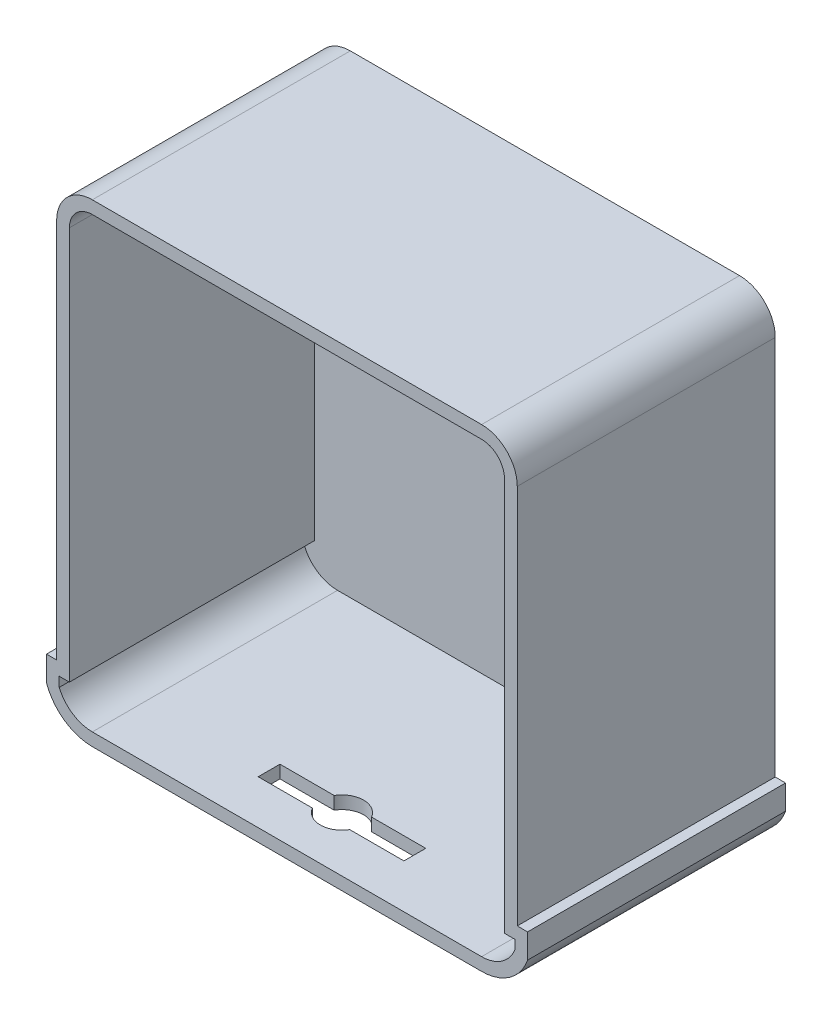
ISO-10303-21;
HEADER;
FILE_DESCRIPTION(('STEP AP214'),'2;1');
FILE_NAME('part.step','',(''),(''),'','','');
FILE_SCHEMA(('AUTOMOTIVE_DESIGN { 1 0 10303 214 1 1 1 1 }'));
ENDSEC;
DATA;
#1=APPLICATION_CONTEXT('core data for automotive mechanical design processes');
#2=APPLICATION_PROTOCOL_DEFINITION('international standard','automotive_design',2000,#1);
#3=PRODUCT_CONTEXT('',#1,'mechanical');
#4=PRODUCT('Part','Part','',(#3));
#5=PRODUCT_RELATED_PRODUCT_CATEGORY('part','',(#4));
#6=PRODUCT_DEFINITION_FORMATION('','',#4);
#7=PRODUCT_DEFINITION_CONTEXT('part definition',#1,'design');
#8=PRODUCT_DEFINITION('design','',#6,#7);
#9=PRODUCT_DEFINITION_SHAPE('','',#8);
#10=(LENGTH_UNIT() NAMED_UNIT(*) SI_UNIT(.MILLI.,.METRE.));
#11=(NAMED_UNIT(*) PLANE_ANGLE_UNIT() SI_UNIT($,.RADIAN.));
#12=(NAMED_UNIT(*) SI_UNIT($,.STERADIAN.) SOLID_ANGLE_UNIT());
#13=UNCERTAINTY_MEASURE_WITH_UNIT(LENGTH_MEASURE(1.E-05),#10,'distance_accuracy_value','');
#14=(GEOMETRIC_REPRESENTATION_CONTEXT(3) GLOBAL_UNCERTAINTY_ASSIGNED_CONTEXT((#13)) GLOBAL_UNIT_ASSIGNED_CONTEXT((#10,
#11,#12)) REPRESENTATION_CONTEXT('',''));
#15=CARTESIAN_POINT('',(0.,0.,0.));
#16=DIRECTION('',(0.,0.,1.));
#17=DIRECTION('',(1.,0.,0.));
#18=AXIS2_PLACEMENT_3D('',#15,#16,#17);
#19=CARTESIAN_POINT('',(-297.471527203187,298.102478214254,10.));
#20=DIRECTION('',(0.,0.,-1.));
#21=DIRECTION('',(-1.,0.,0.));
#22=AXIS2_PLACEMENT_3D('',#19,#20,#21);
#23=CYLINDRICAL_SURFACE('',#22,27.94);
#24=CARTESIAN_POINT('',(-297.471527203187,298.102478214254,0.));
#25=DIRECTION('',(0.,0.,1.));
#26=DIRECTION('',(1.,0.,0.));
#27=AXIS2_PLACEMENT_3D('',#24,#25,#26);
#28=CIRCLE('',#27,27.94);
#29=CARTESIAN_POINT('',(-297.471527203187,326.042478214254,0.));
#30=VERTEX_POINT('',#29);
#31=CARTESIAN_POINT('',(-325.411527203187,298.102478214254,0.));
#32=VERTEX_POINT('',#31);
#33=EDGE_CURVE('E410',#30,#32,#28,.T.);
#34=ORIENTED_EDGE('',*,*,#33,.T.);
#35=DIRECTION('',(0.,0.,-1.));
#36=VECTOR('',#35,1.);
#37=CARTESIAN_POINT('',(-325.411527203187,298.102478214254,10.));
#38=LINE('',#37,#36);
#39=CARTESIAN_POINT('',(-325.411527203187,298.102478214254,202.));
#40=VERTEX_POINT('',#39);
#41=EDGE_CURVE('E468',#40,#32,#38,.T.);
#42=ORIENTED_EDGE('',*,*,#41,.F.);
#43=CARTESIAN_POINT('',(-297.471527203187,298.102478214254,202.));
#44=DIRECTION('',(0.,0.,1.));
#45=DIRECTION('',(1.,0.,0.));
#46=AXIS2_PLACEMENT_3D('',#43,#44,#45);
#47=CIRCLE('',#46,27.94);
#48=CARTESIAN_POINT('',(-297.471527203187,326.042478214254,202.));
#49=VERTEX_POINT('',#48);
#50=EDGE_CURVE('E374',#49,#40,#47,.T.);
#51=ORIENTED_EDGE('',*,*,#50,.F.);
#52=DIRECTION('',(0.,0.,-1.));
#53=VECTOR('',#52,1.);
#54=CARTESIAN_POINT('',(-297.471527203187,326.042478214254,10.));
#55=LINE('',#54,#53);
#56=EDGE_CURVE('E435',#49,#30,#55,.T.);
#57=ORIENTED_EDGE('',*,*,#56,.T.);
#58=EDGE_LOOP('',(#34,#42,#51,#57));
#59=FACE_BOUND('',#58,.T.);
#60=ADVANCED_FACE('F33',(#59),#23,.T.);
#61=CARTESIAN_POINT('',(-325.411527203187,298.102478214254,10.));
#62=DIRECTION('',(1.,0.,0.));
#63=DIRECTION('',(0.,0.,-1.));
#64=AXIS2_PLACEMENT_3D('',#61,#62,#63);
#65=PLANE('',#64);
#66=DIRECTION('',(0.,-1.,0.));
#67=VECTOR('',#66,1.);
#68=CARTESIAN_POINT('',(-325.411527203187,298.102478214254,0.));
#69=LINE('',#68,#67);
#70=CARTESIAN_POINT('',(-325.411527203187,0.,0.));
#71=VERTEX_POINT('',#70);
#72=EDGE_CURVE('E413',#32,#71,#69,.T.);
#73=ORIENTED_EDGE('',*,*,#72,.T.);
#74=DIRECTION('',(0.,0.,-1.));
#75=VECTOR('',#74,1.);
#76=CARTESIAN_POINT('',(-325.411527203187,0.,10.));
#77=LINE('',#76,#75);
#78=CARTESIAN_POINT('',(-325.411527203187,0.,202.));
#79=VERTEX_POINT('',#78);
#80=EDGE_CURVE('E465',#79,#71,#77,.T.);
#81=ORIENTED_EDGE('',*,*,#80,.F.);
#82=DIRECTION('',(0.,-1.,0.));
#83=VECTOR('',#82,1.);
#84=CARTESIAN_POINT('',(-325.411527203187,298.102478214254,202.));
#85=LINE('',#84,#83);
#86=EDGE_CURVE('E377',#40,#79,#85,.T.);
#87=ORIENTED_EDGE('',*,*,#86,.F.);
#88=ORIENTED_EDGE('',*,*,#41,.T.);
#89=EDGE_LOOP('',(#73,#81,#87,#88));
#90=FACE_BOUND('',#89,.T.);
#91=ADVANCED_FACE('F523',(#90),#65,.F.);
#92=CARTESIAN_POINT('',(-325.411527203187,0.,10.));
#93=DIRECTION('',(0.,-1.,0.));
#94=DIRECTION('',(0.,0.,-1.));
#95=AXIS2_PLACEMENT_3D('',#92,#93,#94);
#96=PLANE('',#95);
#97=DIRECTION('',(-1.,0.,0.));
#98=VECTOR('',#97,1.);
#99=CARTESIAN_POINT('',(-325.411527203187,0.,0.));
#100=LINE('',#99,#98);
#101=CARTESIAN_POINT('',(-333.392551687464,0.,0.));
#102=VERTEX_POINT('',#101);
#103=EDGE_CURVE('E415',#71,#102,#100,.T.);
#104=ORIENTED_EDGE('',*,*,#103,.T.);
#105=DIRECTION('',(0.,0.,-1.));
#106=VECTOR('',#105,1.);
#107=CARTESIAN_POINT('',(-333.392551687464,0.,10.));
#108=LINE('',#107,#106);
#109=CARTESIAN_POINT('',(-333.392551687464,0.,202.));
#110=VERTEX_POINT('',#109);
#111=EDGE_CURVE('E462',#110,#102,#108,.T.);
#112=ORIENTED_EDGE('',*,*,#111,.F.);
#113=DIRECTION('',(-1.,0.,0.));
#114=VECTOR('',#113,1.);
#115=CARTESIAN_POINT('',(-325.411527203187,0.,202.));
#116=LINE('',#115,#114);
#117=EDGE_CURVE('E380',#79,#110,#116,.T.);
#118=ORIENTED_EDGE('',*,*,#117,.F.);
#119=ORIENTED_EDGE('',*,*,#80,.T.);
#120=EDGE_LOOP('',(#104,#112,#118,#119));
#121=FACE_BOUND('',#120,.T.);
#122=ADVANCED_FACE('F528',(#121),#96,.F.);
#123=CARTESIAN_POINT('',(-333.392551687464,0.,10.));
#124=DIRECTION('',(1.,0.,0.));
#125=DIRECTION('',(0.,0.,-1.));
#126=AXIS2_PLACEMENT_3D('',#123,#124,#125);
#127=PLANE('',#126);
#128=DIRECTION('',(0.,-1.,0.));
#129=VECTOR('',#128,1.);
#130=CARTESIAN_POINT('',(-333.392551687464,0.,0.));
#131=LINE('',#130,#129);
#132=CARTESIAN_POINT('',(-333.392551687464,-19.3975217857461,0.));
#133=VERTEX_POINT('',#132);
#134=EDGE_CURVE('E417',#102,#133,#131,.T.);
#135=ORIENTED_EDGE('',*,*,#134,.T.);
#136=DIRECTION('',(0.,0.,-1.));
#137=VECTOR('',#136,1.);
#138=CARTESIAN_POINT('',(-333.392551687464,-19.3975217857461,10.));
#139=LINE('',#138,#137);
#140=CARTESIAN_POINT('',(-333.392551687464,-19.397521785746,202.));
#141=VERTEX_POINT('',#140);
#142=EDGE_CURVE('E459',#141,#133,#139,.T.);
#143=ORIENTED_EDGE('',*,*,#142,.F.);
#144=DIRECTION('',(0.,-1.,0.));
#145=VECTOR('',#144,1.);
#146=CARTESIAN_POINT('',(-333.392551687464,0.,202.));
#147=LINE('',#146,#145);
#148=EDGE_CURVE('E383',#110,#141,#147,.T.);
#149=ORIENTED_EDGE('',*,*,#148,.F.);
#150=ORIENTED_EDGE('',*,*,#111,.T.);
#151=EDGE_LOOP('',(#135,#143,#149,#150));
#152=FACE_BOUND('',#151,.T.);
#153=ADVANCED_FACE('F573',(#152),#127,.F.);
#154=CARTESIAN_POINT('',(-297.471527203187,-6.69752178574629,10.));
#155=DIRECTION('',(0.,0.,-1.));
#156=DIRECTION('',(-1.,0.,0.));
#157=AXIS2_PLACEMENT_3D('',#154,#155,#156);
#158=CYLINDRICAL_SURFACE('',#157,38.1);
#159=CARTESIAN_POINT('',(-297.471527203187,-6.69752178574629,0.));
#160=DIRECTION('',(0.,0.,1.));
#161=DIRECTION('',(1.,0.,0.));
#162=AXIS2_PLACEMENT_3D('',#159,#160,#161);
#163=CIRCLE('',#162,38.1);
#164=CARTESIAN_POINT('',(-297.471527203187,-44.7975217857463,0.));
#165=VERTEX_POINT('',#164);
#166=EDGE_CURVE('E419',#133,#165,#163,.T.);
#167=ORIENTED_EDGE('',*,*,#166,.T.);
#168=DIRECTION('',(0.,0.,-1.));
#169=VECTOR('',#168,1.);
#170=CARTESIAN_POINT('',(-297.471527203187,-44.7975217857463,10.));
#171=LINE('',#170,#169);
#172=CARTESIAN_POINT('',(-297.471527203187,-44.7975217857463,202.));
#173=VERTEX_POINT('',#172);
#174=EDGE_CURVE('E456',#173,#165,#171,.T.);
#175=ORIENTED_EDGE('',*,*,#174,.F.);
#176=CARTESIAN_POINT('',(-297.471527203187,-6.69752178574629,202.));
#177=DIRECTION('',(0.,0.,1.));
#178=DIRECTION('',(1.,0.,0.));
#179=AXIS2_PLACEMENT_3D('',#176,#177,#178);
#180=CIRCLE('',#179,38.1);
#181=EDGE_CURVE('E386',#141,#173,#180,.T.);
#182=ORIENTED_EDGE('',*,*,#181,.F.);
#183=ORIENTED_EDGE('',*,*,#142,.T.);
#184=EDGE_LOOP('',(#167,#175,#182,#183));
#185=FACE_BOUND('',#184,.T.);
#186=ADVANCED_FACE('F571',(#185),#158,.T.);
#187=CARTESIAN_POINT('',(-297.471527203187,-44.7975217857463,10.));
#188=DIRECTION('',(0.,1.,0.));
#189=DIRECTION('',(-1.,0.,0.));
#190=AXIS2_PLACEMENT_3D('',#187,#188,#189);
#191=PLANE('',#190);
#192=DIRECTION('',(1.,0.,0.));
#193=VECTOR('',#192,1.);
#194=CARTESIAN_POINT('',(0.,-44.7975217857463,167.470752042719));
#195=LINE('',#194,#193);
#196=CARTESIAN_POINT('',(-202.139258915088,-44.7975217857463,167.470752042719));
#197=VERTEX_POINT('',#196);
#198=CARTESIAN_POINT('',(-159.697342474204,-44.7975217857463,167.470752042719));
#199=VERTEX_POINT('',#198);
#200=EDGE_CURVE('E252',#197,#199,#195,.T.);
#201=ORIENTED_EDGE('',*,*,#200,.T.);
#202=CARTESIAN_POINT('',(-145.071527203187,-44.7975217857463,158.941242201002));
#203=DIRECTION('',(0.,-1.,0.));
#204=DIRECTION('',(0.,0.,-1.));
#205=AXIS2_PLACEMENT_3D('',#202,#203,#204);
#206=CIRCLE('',#205,16.9312436188795);
#207=CARTESIAN_POINT('',(-130.44571193217,-44.7975217857463,167.470752042719));
#208=VERTEX_POINT('',#207);
#209=EDGE_CURVE('E47',#208,#199,#206,.T.);
#210=ORIENTED_EDGE('',*,*,#209,.F.);
#211=DIRECTION('',(1.,0.,0.));
#212=VECTOR('',#211,1.);
#213=CARTESIAN_POINT('',(0.,-44.7975217857463,167.470752042719));
#214=LINE('',#213,#212);
#215=CARTESIAN_POINT('',(-88.0037954912858,-44.7975217857463,167.470752042719));
#216=VERTEX_POINT('',#215);
#217=EDGE_CURVE('E274',#208,#216,#214,.T.);
#218=ORIENTED_EDGE('',*,*,#217,.T.);
#219=DIRECTION('',(0.,0.,1.));
#220=VECTOR('',#219,1.);
#221=CARTESIAN_POINT('',(-88.0037954912858,-44.7975217857463,0.));
#222=LINE('',#221,#220);
#223=CARTESIAN_POINT('',(-88.0037954912858,-44.7975217857463,150.411732359285));
#224=VERTEX_POINT('',#223);
#225=EDGE_CURVE('E271',#224,#216,#222,.T.);
#226=ORIENTED_EDGE('',*,*,#225,.F.);
#227=DIRECTION('',(1.,0.,0.));
#228=VECTOR('',#227,1.);
#229=CARTESIAN_POINT('',(0.,-44.7975217857463,150.411732359285));
#230=LINE('',#229,#228);
#231=CARTESIAN_POINT('',(-130.44571193217,-44.7975217857463,150.411732359285));
#232=VERTEX_POINT('',#231);
#233=EDGE_CURVE('E268',#232,#224,#230,.T.);
#234=ORIENTED_EDGE('',*,*,#233,.F.);
#235=CARTESIAN_POINT('',(-145.071527203187,-44.7975217857463,158.941242201002));
#236=DIRECTION('',(0.,-1.,0.));
#237=DIRECTION('',(0.,0.,-1.));
#238=AXIS2_PLACEMENT_3D('',#235,#236,#237);
#239=CIRCLE('',#238,16.9312436188795);
#240=CARTESIAN_POINT('',(-159.697342474204,-44.7975217857463,150.411732359285));
#241=VERTEX_POINT('',#240);
#242=EDGE_CURVE('E262',#241,#232,#239,.T.);
#243=ORIENTED_EDGE('',*,*,#242,.F.);
#244=DIRECTION('',(1.,0.,0.));
#245=VECTOR('',#244,1.);
#246=CARTESIAN_POINT('',(0.,-44.7975217857463,150.411732359285));
#247=LINE('',#246,#245);
#248=CARTESIAN_POINT('',(-202.139258915088,-44.7975217857463,150.411732359285));
#249=VERTEX_POINT('',#248);
#250=EDGE_CURVE('E260',#249,#241,#247,.T.);
#251=ORIENTED_EDGE('',*,*,#250,.F.);
#252=DIRECTION('',(0.,0.,1.));
#253=VECTOR('',#252,1.);
#254=CARTESIAN_POINT('',(-202.139258915088,-44.7975217857463,0.));
#255=LINE('',#254,#253);
#256=EDGE_CURVE('E243',#249,#197,#255,.T.);
#257=ORIENTED_EDGE('',*,*,#256,.T.);
#258=EDGE_LOOP('',(#201,#210,#218,#226,#234,#243,#251,#257));
#259=FACE_BOUND('',#258,.T.);
#260=DIRECTION('',(1.,0.,0.));
#261=VECTOR('',#260,1.);
#262=CARTESIAN_POINT('',(-297.471527203187,-44.7975217857463,0.));
#263=LINE('',#262,#261);
#264=CARTESIAN_POINT('',(7.32847279681311,-44.7975217857463,0.));
#265=VERTEX_POINT('',#264);
#266=EDGE_CURVE('E421',#165,#265,#263,.T.);
#267=ORIENTED_EDGE('',*,*,#266,.T.);
#268=DIRECTION('',(0.,0.,-1.));
#269=VECTOR('',#268,1.);
#270=CARTESIAN_POINT('',(7.32847279681311,-44.7975217857463,10.));
#271=LINE('',#270,#269);
#272=CARTESIAN_POINT('',(7.3284727968131,-44.7975217857463,202.));
#273=VERTEX_POINT('',#272);
#274=EDGE_CURVE('E453',#273,#265,#271,.T.);
#275=ORIENTED_EDGE('',*,*,#274,.F.);
#276=DIRECTION('',(1.,0.,0.));
#277=VECTOR('',#276,1.);
#278=CARTESIAN_POINT('',(-297.471527203187,-44.7975217857463,202.));
#279=LINE('',#278,#277);
#280=EDGE_CURVE('E389',#173,#273,#279,.T.);
#281=ORIENTED_EDGE('',*,*,#280,.F.);
#282=ORIENTED_EDGE('',*,*,#174,.T.);
#283=EDGE_LOOP('',(#267,#275,#281,#282));
#284=FACE_BOUND('',#283,.T.);
#285=ADVANCED_FACE('F256',(#259,#284),#191,.F.);
#286=CARTESIAN_POINT('',(7.32847279681311,-6.69752178574631,10.));
#287=DIRECTION('',(0.,0.,-1.));
#288=DIRECTION('',(-1.,0.,0.));
#289=AXIS2_PLACEMENT_3D('',#286,#287,#288);
#290=CYLINDRICAL_SURFACE('',#289,38.1);
#291=CARTESIAN_POINT('',(7.32847279681311,-6.69752178574631,0.));
#292=DIRECTION('',(0.,0.,1.));
#293=DIRECTION('',(1.,0.,0.));
#294=AXIS2_PLACEMENT_3D('',#291,#292,#293);
#295=CIRCLE('',#294,38.1);
#296=CARTESIAN_POINT('',(43.3314357071176,-19.1633415212968,0.));
#297=VERTEX_POINT('',#296);
#298=EDGE_CURVE('E423',#265,#297,#295,.T.);
#299=ORIENTED_EDGE('',*,*,#298,.T.);
#300=DIRECTION('',(0.,0.,-1.));
#301=VECTOR('',#300,1.);
#302=CARTESIAN_POINT('',(43.3314357071176,-19.1633415212968,10.));
#303=LINE('',#302,#301);
#304=CARTESIAN_POINT('',(43.3314357071176,-19.1633415212968,202.));
#305=VERTEX_POINT('',#304);
#306=EDGE_CURVE('E450',#305,#297,#303,.T.);
#307=ORIENTED_EDGE('',*,*,#306,.F.);
#308=CARTESIAN_POINT('',(7.32847279681311,-6.69752178574631,202.));
#309=DIRECTION('',(0.,0.,1.));
#310=DIRECTION('',(1.,0.,0.));
#311=AXIS2_PLACEMENT_3D('',#308,#309,#310);
#312=CIRCLE('',#311,38.1);
#313=EDGE_CURVE('E392',#273,#305,#312,.T.);
#314=ORIENTED_EDGE('',*,*,#313,.F.);
#315=ORIENTED_EDGE('',*,*,#274,.T.);
#316=EDGE_LOOP('',(#299,#307,#314,#315));
#317=FACE_BOUND('',#316,.T.);
#318=ADVANCED_FACE('F566',(#317),#290,.T.);
#319=CARTESIAN_POINT('',(43.3314357071176,-19.1633415212968,10.));
#320=DIRECTION('',(-1.,0.,0.));
#321=DIRECTION('',(0.,0.,1.));
#322=AXIS2_PLACEMENT_3D('',#319,#320,#321);
#323=PLANE('',#322);
#324=DIRECTION('',(0.,1.,0.));
#325=VECTOR('',#324,1.);
#326=CARTESIAN_POINT('',(43.3314357071176,-19.1633415212968,0.));
#327=LINE('',#326,#325);
#328=CARTESIAN_POINT('',(43.3314357071176,0.,0.));
#329=VERTEX_POINT('',#328);
#330=EDGE_CURVE('E425',#297,#329,#327,.T.);
#331=ORIENTED_EDGE('',*,*,#330,.T.);
#332=DIRECTION('',(0.,0.,-1.));
#333=VECTOR('',#332,1.);
#334=CARTESIAN_POINT('',(43.3314357071176,0.,10.));
#335=LINE('',#334,#333);
#336=CARTESIAN_POINT('',(43.3314357071176,0.,202.));
#337=VERTEX_POINT('',#336);
#338=EDGE_CURVE('E447',#337,#329,#335,.T.);
#339=ORIENTED_EDGE('',*,*,#338,.F.);
#340=DIRECTION('',(0.,1.,0.));
#341=VECTOR('',#340,1.);
#342=CARTESIAN_POINT('',(43.3314357071176,-19.1633415212968,202.));
#343=LINE('',#342,#341);
#344=EDGE_CURVE('E395',#305,#337,#343,.T.);
#345=ORIENTED_EDGE('',*,*,#344,.F.);
#346=ORIENTED_EDGE('',*,*,#306,.T.);
#347=EDGE_LOOP('',(#331,#339,#345,#346));
#348=FACE_BOUND('',#347,.T.);
#349=ADVANCED_FACE('F561',(#348),#323,.F.);
#350=CARTESIAN_POINT('',(43.3314357071176,0.,10.));
#351=DIRECTION('',(0.,-1.,0.));
#352=DIRECTION('',(0.,0.,-1.));
#353=AXIS2_PLACEMENT_3D('',#350,#351,#352);
#354=PLANE('',#353);
#355=DIRECTION('',(-1.,0.,0.));
#356=VECTOR('',#355,1.);
#357=CARTESIAN_POINT('',(43.3314357071176,0.,0.));
#358=LINE('',#357,#356);
#359=CARTESIAN_POINT('',(35.2684727968131,0.,0.));
#360=VERTEX_POINT('',#359);
#361=EDGE_CURVE('E427',#329,#360,#358,.T.);
#362=ORIENTED_EDGE('',*,*,#361,.T.);
#363=DIRECTION('',(0.,0.,-1.));
#364=VECTOR('',#363,1.);
#365=CARTESIAN_POINT('',(35.2684727968131,0.,10.));
#366=LINE('',#365,#364);
#367=CARTESIAN_POINT('',(35.2684727968131,0.,202.));
#368=VERTEX_POINT('',#367);
#369=EDGE_CURVE('E444',#368,#360,#366,.T.);
#370=ORIENTED_EDGE('',*,*,#369,.F.);
#371=DIRECTION('',(-1.,0.,0.));
#372=VECTOR('',#371,1.);
#373=CARTESIAN_POINT('',(43.3314357071176,0.,202.));
#374=LINE('',#373,#372);
#375=EDGE_CURVE('E398',#337,#368,#374,.T.);
#376=ORIENTED_EDGE('',*,*,#375,.F.);
#377=ORIENTED_EDGE('',*,*,#338,.T.);
#378=EDGE_LOOP('',(#362,#370,#376,#377));
#379=FACE_BOUND('',#378,.T.);
#380=ADVANCED_FACE('F557',(#379),#354,.F.);
#381=CARTESIAN_POINT('',(35.2684727968131,0.,10.));
#382=DIRECTION('',(-1.,0.,0.));
#383=DIRECTION('',(0.,-1.,0.));
#384=AXIS2_PLACEMENT_3D('',#381,#382,#383);
#385=PLANE('',#384);
#386=DIRECTION('',(0.,1.,0.));
#387=VECTOR('',#386,1.);
#388=CARTESIAN_POINT('',(35.2684727968131,0.,0.));
#389=LINE('',#388,#387);
#390=CARTESIAN_POINT('',(35.2684727968131,298.102478214254,0.));
#391=VERTEX_POINT('',#390);
#392=EDGE_CURVE('E429',#360,#391,#389,.T.);
#393=ORIENTED_EDGE('',*,*,#392,.T.);
#394=DIRECTION('',(0.,0.,-1.));
#395=VECTOR('',#394,1.);
#396=CARTESIAN_POINT('',(35.2684727968131,298.102478214254,10.));
#397=LINE('',#396,#395);
#398=CARTESIAN_POINT('',(35.2684727968131,298.102478214254,202.));
#399=VERTEX_POINT('',#398);
#400=EDGE_CURVE('E441',#399,#391,#397,.T.);
#401=ORIENTED_EDGE('',*,*,#400,.F.);
#402=DIRECTION('',(0.,1.,0.));
#403=VECTOR('',#402,1.);
#404=CARTESIAN_POINT('',(35.2684727968131,0.,202.));
#405=LINE('',#404,#403);
#406=EDGE_CURVE('E401',#368,#399,#405,.T.);
#407=ORIENTED_EDGE('',*,*,#406,.F.);
#408=ORIENTED_EDGE('',*,*,#369,.T.);
#409=EDGE_LOOP('',(#393,#401,#407,#408));
#410=FACE_BOUND('',#409,.T.);
#411=ADVANCED_FACE('F553',(#410),#385,.F.);
#412=CARTESIAN_POINT('',(7.32847279681303,298.102478214254,10.));
#413=DIRECTION('',(0.,0.,-1.));
#414=DIRECTION('',(-1.,0.,0.));
#415=AXIS2_PLACEMENT_3D('',#412,#413,#414);
#416=CYLINDRICAL_SURFACE('',#415,27.94);
#417=CARTESIAN_POINT('',(7.32847279681303,298.102478214254,0.));
#418=DIRECTION('',(0.,0.,1.));
#419=DIRECTION('',(1.,0.,0.));
#420=AXIS2_PLACEMENT_3D('',#417,#418,#419);
#421=CIRCLE('',#420,27.94);
#422=CARTESIAN_POINT('',(7.32847279681304,326.042478214254,0.));
#423=VERTEX_POINT('',#422);
#424=EDGE_CURVE('E431',#391,#423,#421,.T.);
#425=ORIENTED_EDGE('',*,*,#424,.T.);
#426=DIRECTION('',(0.,0.,-1.));
#427=VECTOR('',#426,1.);
#428=CARTESIAN_POINT('',(7.32847279681304,326.042478214254,10.));
#429=LINE('',#428,#427);
#430=CARTESIAN_POINT('',(7.32847279681304,326.042478214254,202.));
#431=VERTEX_POINT('',#430);
#432=EDGE_CURVE('E438',#431,#423,#429,.T.);
#433=ORIENTED_EDGE('',*,*,#432,.F.);
#434=CARTESIAN_POINT('',(7.32847279681303,298.102478214254,202.));
#435=DIRECTION('',(0.,0.,1.));
#436=DIRECTION('',(1.,0.,0.));
#437=AXIS2_PLACEMENT_3D('',#434,#435,#436);
#438=CIRCLE('',#437,27.94);
#439=EDGE_CURVE('E404',#399,#431,#438,.T.);
#440=ORIENTED_EDGE('',*,*,#439,.F.);
#441=ORIENTED_EDGE('',*,*,#400,.T.);
#442=EDGE_LOOP('',(#425,#433,#440,#441));
#443=FACE_BOUND('',#442,.T.);
#444=ADVANCED_FACE('F548',(#443),#416,.T.);
#445=CARTESIAN_POINT('',(7.32847279681304,326.042478214254,10.));
#446=DIRECTION('',(0.,-1.,0.));
#447=DIRECTION('',(1.,0.,0.));
#448=AXIS2_PLACEMENT_3D('',#445,#446,#447);
#449=PLANE('',#448);
#450=DIRECTION('',(-1.,0.,0.));
#451=VECTOR('',#450,1.);
#452=CARTESIAN_POINT('',(7.32847279681304,326.042478214254,0.));
#453=LINE('',#452,#451);
#454=EDGE_CURVE('E433',#423,#30,#453,.T.);
#455=ORIENTED_EDGE('',*,*,#454,.T.);
#456=ORIENTED_EDGE('',*,*,#56,.F.);
#457=DIRECTION('',(-1.,0.,0.));
#458=VECTOR('',#457,1.);
#459=CARTESIAN_POINT('',(7.32847279681304,326.042478214254,202.));
#460=LINE('',#459,#458);
#461=EDGE_CURVE('E407',#431,#49,#460,.T.);
#462=ORIENTED_EDGE('',*,*,#461,.F.);
#463=ORIENTED_EDGE('',*,*,#432,.T.);
#464=EDGE_LOOP('',(#455,#456,#462,#463));
#465=FACE_BOUND('',#464,.T.);
#466=ADVANCED_FACE('F546',(#465),#449,.F.);
#467=CARTESIAN_POINT('',(-297.471527203187,298.102478214254,0.));
#468=DIRECTION('',(0.,0.,1.));
#469=DIRECTION('',(1.,0.,0.));
#470=AXIS2_PLACEMENT_3D('',#467,#468,#469);
#471=PLANE('',#470);
#472=ORIENTED_EDGE('',*,*,#33,.F.);
#473=ORIENTED_EDGE('',*,*,#454,.F.);
#474=ORIENTED_EDGE('',*,*,#424,.F.);
#475=ORIENTED_EDGE('',*,*,#392,.F.);
#476=ORIENTED_EDGE('',*,*,#361,.F.);
#477=ORIENTED_EDGE('',*,*,#330,.F.);
#478=ORIENTED_EDGE('',*,*,#298,.F.);
#479=ORIENTED_EDGE('',*,*,#266,.F.);
#480=ORIENTED_EDGE('',*,*,#166,.F.);
#481=ORIENTED_EDGE('',*,*,#134,.F.);
#482=ORIENTED_EDGE('',*,*,#103,.F.);
#483=ORIENTED_EDGE('',*,*,#72,.F.);
#484=EDGE_LOOP('',(#472,#473,#474,#475,#476,#477,#478,#479,#480,#481,#482,#483));
#485=FACE_BOUND('',#484,.T.);
#486=ADVANCED_FACE('F535',(#485),#471,.F.);
#487=CARTESIAN_POINT('',(-297.471527203187,298.102478214254,202.));
#488=DIRECTION('',(0.,0.,1.));
#489=DIRECTION('',(1.,0.,0.));
#490=AXIS2_PLACEMENT_3D('',#487,#488,#489);
#491=PLANE('',#490);
#492=ORIENTED_EDGE('',*,*,#50,.T.);
#493=ORIENTED_EDGE('',*,*,#86,.T.);
#494=ORIENTED_EDGE('',*,*,#117,.T.);
#495=ORIENTED_EDGE('',*,*,#148,.T.);
#496=ORIENTED_EDGE('',*,*,#181,.T.);
#497=ORIENTED_EDGE('',*,*,#280,.T.);
#498=ORIENTED_EDGE('',*,*,#313,.T.);
#499=ORIENTED_EDGE('',*,*,#344,.T.);
#500=ORIENTED_EDGE('',*,*,#375,.T.);
#501=ORIENTED_EDGE('',*,*,#406,.T.);
#502=ORIENTED_EDGE('',*,*,#439,.T.);
#503=ORIENTED_EDGE('',*,*,#461,.T.);
#504=EDGE_LOOP('',(#492,#493,#494,#495,#496,#497,#498,#499,#500,#501,#502,#503));
#505=FACE_BOUND('',#504,.T.);
#506=DIRECTION('',(0.,-1.,0.));
#507=VECTOR('',#506,1.);
#508=CARTESIAN_POINT('',(-315.411527203187,298.102478214254,202.));
#509=LINE('',#508,#507);
#510=CARTESIAN_POINT('',(-315.411527203187,298.102478214254,202.));
#511=VERTEX_POINT('',#510);
#512=CARTESIAN_POINT('',(-315.411527203187,-10.,202.));
#513=VERTEX_POINT('',#512);
#514=EDGE_CURVE('E292',#511,#513,#509,.T.);
#515=ORIENTED_EDGE('',*,*,#514,.F.);
#516=CARTESIAN_POINT('',(-297.471527203187,298.102478214254,202.));
#517=DIRECTION('',(0.,0.,1.));
#518=DIRECTION('',(1.,0.,0.));
#519=AXIS2_PLACEMENT_3D('',#516,#517,#518);
#520=CIRCLE('',#519,17.94);
#521=CARTESIAN_POINT('',(-297.471527203187,316.042478214254,202.));
#522=VERTEX_POINT('',#521);
#523=EDGE_CURVE('E290',#522,#511,#520,.T.);
#524=ORIENTED_EDGE('',*,*,#523,.F.);
#525=DIRECTION('',(-1.,0.,0.));
#526=VECTOR('',#525,1.);
#527=CARTESIAN_POINT('',(7.32847279681304,316.042478214254,202.));
#528=LINE('',#527,#526);
#529=CARTESIAN_POINT('',(7.32847279681309,316.042478214254,202.));
#530=VERTEX_POINT('',#529);
#531=EDGE_CURVE('E314',#530,#522,#528,.T.);
#532=ORIENTED_EDGE('',*,*,#531,.F.);
#533=CARTESIAN_POINT('',(7.32847279681303,298.102478214254,202.));
#534=DIRECTION('',(0.,0.,1.));
#535=DIRECTION('',(1.,0.,0.));
#536=AXIS2_PLACEMENT_3D('',#533,#534,#535);
#537=CIRCLE('',#536,17.94);
#538=CARTESIAN_POINT('',(25.2684727968131,298.102478214254,202.));
#539=VERTEX_POINT('',#538);
#540=EDGE_CURVE('E311',#539,#530,#537,.T.);
#541=ORIENTED_EDGE('',*,*,#540,.F.);
#542=DIRECTION('',(0.,1.,0.));
#543=VECTOR('',#542,1.);
#544=CARTESIAN_POINT('',(25.2684727968131,-10.,202.));
#545=LINE('',#544,#543);
#546=CARTESIAN_POINT('',(25.2684727968131,-10.,202.));
#547=VERTEX_POINT('',#546);
#548=EDGE_CURVE('E309',#547,#539,#545,.T.);
#549=ORIENTED_EDGE('',*,*,#548,.F.);
#550=DIRECTION('',(-1.,0.,0.));
#551=VECTOR('',#550,1.);
#552=CARTESIAN_POINT('',(33.3314357071176,-10.,202.));
#553=LINE('',#552,#551);
#554=CARTESIAN_POINT('',(33.3314357071176,-10.,202.));
#555=VERTEX_POINT('',#554);
#556=EDGE_CURVE('E307',#555,#547,#553,.T.);
#557=ORIENTED_EDGE('',*,*,#556,.F.);
#558=DIRECTION('',(0.,1.,0.));
#559=VECTOR('',#558,1.);
#560=CARTESIAN_POINT('',(33.3314357071176,-17.3490906788873,202.));
#561=LINE('',#560,#559);
#562=CARTESIAN_POINT('',(33.3314357071176,-17.3490906788873,202.));
#563=VERTEX_POINT('',#562);
#564=EDGE_CURVE('E305',#563,#555,#561,.T.);
#565=ORIENTED_EDGE('',*,*,#564,.F.);
#566=CARTESIAN_POINT('',(7.32847279681311,-6.69752178574631,202.));
#567=DIRECTION('',(0.,0.,1.));
#568=DIRECTION('',(1.,0.,0.));
#569=AXIS2_PLACEMENT_3D('',#566,#567,#568);
#570=CIRCLE('',#569,28.1);
#571=CARTESIAN_POINT('',(7.32847279681308,-34.7975217857463,202.));
#572=VERTEX_POINT('',#571);
#573=EDGE_CURVE('E303',#572,#563,#570,.T.);
#574=ORIENTED_EDGE('',*,*,#573,.F.);
#575=DIRECTION('',(1.,0.,0.));
#576=VECTOR('',#575,1.);
#577=CARTESIAN_POINT('',(-297.471527203187,-34.7975217857463,202.));
#578=LINE('',#577,#576);
#579=CARTESIAN_POINT('',(-297.471527203187,-34.7975217857463,202.));
#580=VERTEX_POINT('',#579);
#581=EDGE_CURVE('E301',#580,#572,#578,.T.);
#582=ORIENTED_EDGE('',*,*,#581,.F.);
#583=CARTESIAN_POINT('',(-297.471527203187,-6.69752178574629,202.));
#584=DIRECTION('',(0.,0.,1.));
#585=DIRECTION('',(1.,0.,0.));
#586=AXIS2_PLACEMENT_3D('',#583,#584,#585);
#587=CIRCLE('',#586,28.1);
#588=CARTESIAN_POINT('',(-323.392551687464,-17.546968300916,202.));
#589=VERTEX_POINT('',#588);
#590=EDGE_CURVE('E299',#589,#580,#587,.T.);
#591=ORIENTED_EDGE('',*,*,#590,.F.);
#592=DIRECTION('',(0.,-1.,0.));
#593=VECTOR('',#592,1.);
#594=CARTESIAN_POINT('',(-323.392551687464,-10.,202.));
#595=LINE('',#594,#593);
#596=CARTESIAN_POINT('',(-323.392551687464,-10.,202.));
#597=VERTEX_POINT('',#596);
#598=EDGE_CURVE('E297',#597,#589,#595,.T.);
#599=ORIENTED_EDGE('',*,*,#598,.F.);
#600=DIRECTION('',(-1.,0.,0.));
#601=VECTOR('',#600,1.);
#602=CARTESIAN_POINT('',(-315.411527203187,-10.,202.));
#603=LINE('',#602,#601);
#604=EDGE_CURVE('E295',#513,#597,#603,.T.);
#605=ORIENTED_EDGE('',*,*,#604,.F.);
#606=EDGE_LOOP('',(#515,#524,#532,#541,#549,#557,#565,#574,#582,#591,#599,#605));
#607=FACE_BOUND('',#606,.T.);
#608=ADVANCED_FACE('F541',(#505,#607),#491,.T.);
#609=CARTESIAN_POINT('',(-297.471527203187,298.102478214254,202.));
#610=DIRECTION('',(0.,0.,-1.));
#611=DIRECTION('',(-1.,0.,0.));
#612=AXIS2_PLACEMENT_3D('',#609,#610,#611);
#613=CYLINDRICAL_SURFACE('',#612,17.94);
#614=CARTESIAN_POINT('',(-297.471527203187,298.102478214254,10.));
#615=DIRECTION('',(0.,0.,1.));
#616=DIRECTION('',(1.,0.,0.));
#617=AXIS2_PLACEMENT_3D('',#614,#615,#616);
#618=CIRCLE('',#617,17.94);
#619=CARTESIAN_POINT('',(-297.471527203187,316.042478214254,10.));
#620=VERTEX_POINT('',#619);
#621=CARTESIAN_POINT('',(-315.411527203187,298.102478214254,10.));
#622=VERTEX_POINT('',#621);
#623=EDGE_CURVE('E279',#620,#622,#618,.T.);
#624=ORIENTED_EDGE('',*,*,#623,.F.);
#625=DIRECTION('',(0.,0.,-1.));
#626=VECTOR('',#625,1.);
#627=CARTESIAN_POINT('',(-297.471527203187,316.042478214254,202.));
#628=LINE('',#627,#626);
#629=EDGE_CURVE('E316',#522,#620,#628,.T.);
#630=ORIENTED_EDGE('',*,*,#629,.F.);
#631=ORIENTED_EDGE('',*,*,#523,.T.);
#632=DIRECTION('',(0.,0.,-1.));
#633=VECTOR('',#632,1.);
#634=CARTESIAN_POINT('',(-315.411527203187,298.102478214254,202.));
#635=LINE('',#634,#633);
#636=EDGE_CURVE('E371',#511,#622,#635,.T.);
#637=ORIENTED_EDGE('',*,*,#636,.T.);
#638=EDGE_LOOP('',(#624,#630,#631,#637));
#639=FACE_BOUND('',#638,.T.);
#640=ADVANCED_FACE('F602',(#639),#613,.F.);
#641=CARTESIAN_POINT('',(-315.411527203187,298.102478214254,202.));
#642=DIRECTION('',(1.,0.,0.));
#643=DIRECTION('',(0.,0.,-1.));
#644=AXIS2_PLACEMENT_3D('',#641,#642,#643);
#645=PLANE('',#644);
#646=DIRECTION('',(0.,-1.,0.));
#647=VECTOR('',#646,1.);
#648=CARTESIAN_POINT('',(-315.411527203187,298.102478214254,10.));
#649=LINE('',#648,#647);
#650=CARTESIAN_POINT('',(-315.411527203187,-10.,10.));
#651=VERTEX_POINT('',#650);
#652=EDGE_CURVE('E318',#622,#651,#649,.T.);
#653=ORIENTED_EDGE('',*,*,#652,.F.);
#654=ORIENTED_EDGE('',*,*,#636,.F.);
#655=ORIENTED_EDGE('',*,*,#514,.T.);
#656=DIRECTION('',(0.,0.,-1.));
#657=VECTOR('',#656,1.);
#658=CARTESIAN_POINT('',(-315.411527203187,-10.,202.));
#659=LINE('',#658,#657);
#660=EDGE_CURVE('E368',#513,#651,#659,.T.);
#661=ORIENTED_EDGE('',*,*,#660,.T.);
#662=EDGE_LOOP('',(#653,#654,#655,#661));
#663=FACE_BOUND('',#662,.T.);
#664=ADVANCED_FACE('F605',(#663),#645,.T.);
#665=CARTESIAN_POINT('',(-315.411527203187,-10.,202.));
#666=DIRECTION('',(0.,-1.,0.));
#667=DIRECTION('',(0.,0.,-1.));
#668=AXIS2_PLACEMENT_3D('',#665,#666,#667);
#669=PLANE('',#668);
#670=DIRECTION('',(-1.,0.,0.));
#671=VECTOR('',#670,1.);
#672=CARTESIAN_POINT('',(-315.411527203187,-10.,10.));
#673=LINE('',#672,#671);
#674=CARTESIAN_POINT('',(-323.392551687464,-10.,10.));
#675=VERTEX_POINT('',#674);
#676=EDGE_CURVE('E320',#651,#675,#673,.T.);
#677=ORIENTED_EDGE('',*,*,#676,.F.);
#678=ORIENTED_EDGE('',*,*,#660,.F.);
#679=ORIENTED_EDGE('',*,*,#604,.T.);
#680=DIRECTION('',(0.,0.,-1.));
#681=VECTOR('',#680,1.);
#682=CARTESIAN_POINT('',(-323.392551687464,-10.,202.));
#683=LINE('',#682,#681);
#684=EDGE_CURVE('E365',#597,#675,#683,.T.);
#685=ORIENTED_EDGE('',*,*,#684,.T.);
#686=EDGE_LOOP('',(#677,#678,#679,#685));
#687=FACE_BOUND('',#686,.T.);
#688=ADVANCED_FACE('F609',(#687),#669,.T.);
#689=CARTESIAN_POINT('',(-323.392551687464,-10.,202.));
#690=DIRECTION('',(1.,0.,0.));
#691=DIRECTION('',(0.,0.,-1.));
#692=AXIS2_PLACEMENT_3D('',#689,#690,#691);
#693=PLANE('',#692);
#694=DIRECTION('',(0.,-1.,0.));
#695=VECTOR('',#694,1.);
#696=CARTESIAN_POINT('',(-323.392551687464,-10.,10.));
#697=LINE('',#696,#695);
#698=CARTESIAN_POINT('',(-323.392551687464,-17.546968300916,10.));
#699=VERTEX_POINT('',#698);
#700=EDGE_CURVE('E322',#675,#699,#697,.T.);
#701=ORIENTED_EDGE('',*,*,#700,.F.);
#702=ORIENTED_EDGE('',*,*,#684,.F.);
#703=ORIENTED_EDGE('',*,*,#598,.T.);
#704=DIRECTION('',(0.,0.,-1.));
#705=VECTOR('',#704,1.);
#706=CARTESIAN_POINT('',(-323.392551687464,-17.546968300916,202.));
#707=LINE('',#706,#705);
#708=EDGE_CURVE('E362',#589,#699,#707,.T.);
#709=ORIENTED_EDGE('',*,*,#708,.T.);
#710=EDGE_LOOP('',(#701,#702,#703,#709));
#711=FACE_BOUND('',#710,.T.);
#712=ADVANCED_FACE('F613',(#711),#693,.T.);
#713=CARTESIAN_POINT('',(-297.471527203187,-6.69752178574629,202.));
#714=DIRECTION('',(0.,0.,-1.));
#715=DIRECTION('',(-1.,0.,0.));
#716=AXIS2_PLACEMENT_3D('',#713,#714,#715);
#717=CYLINDRICAL_SURFACE('',#716,28.1);
#718=CARTESIAN_POINT('',(-297.471527203187,-6.69752178574629,10.));
#719=DIRECTION('',(0.,0.,1.));
#720=DIRECTION('',(1.,0.,0.));
#721=AXIS2_PLACEMENT_3D('',#718,#719,#720);
#722=CIRCLE('',#721,28.1);
#723=CARTESIAN_POINT('',(-297.471527203187,-34.7975217857463,10.));
#724=VERTEX_POINT('',#723);
#725=EDGE_CURVE('E324',#699,#724,#722,.T.);
#726=ORIENTED_EDGE('',*,*,#725,.F.);
#727=ORIENTED_EDGE('',*,*,#708,.F.);
#728=ORIENTED_EDGE('',*,*,#590,.T.);
#729=DIRECTION('',(0.,0.,-1.));
#730=VECTOR('',#729,1.);
#731=CARTESIAN_POINT('',(-297.471527203187,-34.7975217857463,202.));
#732=LINE('',#731,#730);
#733=EDGE_CURVE('E359',#580,#724,#732,.T.);
#734=ORIENTED_EDGE('',*,*,#733,.T.);
#735=EDGE_LOOP('',(#726,#727,#728,#734));
#736=FACE_BOUND('',#735,.T.);
#737=ADVANCED_FACE('F617',(#736),#717,.F.);
#738=CARTESIAN_POINT('',(-297.471527203187,-34.7975217857463,202.));
#739=DIRECTION('',(0.,1.,0.));
#740=DIRECTION('',(-1.,0.,0.));
#741=AXIS2_PLACEMENT_3D('',#738,#739,#740);
#742=PLANE('',#741);
#743=CARTESIAN_POINT('',(-145.071527203187,-34.7975217857463,158.941242201002));
#744=DIRECTION('',(0.,1.,0.));
#745=DIRECTION('',(-1.,0.,0.));
#746=AXIS2_PLACEMENT_3D('',#743,#744,#745);
#747=CIRCLE('',#746,16.9312436188795);
#748=CARTESIAN_POINT('',(-159.697342474204,-34.7975217857463,167.470752042719));
#749=VERTEX_POINT('',#748);
#750=CARTESIAN_POINT('',(-130.44571193217,-34.7975217857463,167.470752042719));
#751=VERTEX_POINT('',#750);
#752=EDGE_CURVE('E11',#749,#751,#747,.T.);
#753=ORIENTED_EDGE('',*,*,#752,.F.);
#754=DIRECTION('',(-1.,0.,0.));
#755=VECTOR('',#754,1.);
#756=CARTESIAN_POINT('',(-297.471527203187,-34.7975217857463,167.470752042719));
#757=LINE('',#756,#755);
#758=CARTESIAN_POINT('',(-202.139258915088,-34.7975217857463,167.470752042719));
#759=VERTEX_POINT('',#758);
#760=EDGE_CURVE('E471',#749,#759,#757,.T.);
#761=ORIENTED_EDGE('',*,*,#760,.T.);
#762=DIRECTION('',(0.,0.,-1.));
#763=VECTOR('',#762,1.);
#764=CARTESIAN_POINT('',(-202.139258915088,-34.7975217857463,202.));
#765=LINE('',#764,#763);
#766=CARTESIAN_POINT('',(-202.139258915088,-34.7975217857463,150.411732359285));
#767=VERTEX_POINT('',#766);
#768=EDGE_CURVE('E246',#759,#767,#765,.T.);
#769=ORIENTED_EDGE('',*,*,#768,.T.);
#770=DIRECTION('',(-1.,0.,0.));
#771=VECTOR('',#770,1.);
#772=CARTESIAN_POINT('',(-297.471527203187,-34.7975217857463,150.411732359285));
#773=LINE('',#772,#771);
#774=CARTESIAN_POINT('',(-159.697342474204,-34.7975217857463,150.411732359285));
#775=VERTEX_POINT('',#774);
#776=EDGE_CURVE('E474',#775,#767,#773,.T.);
#777=ORIENTED_EDGE('',*,*,#776,.F.);
#778=CARTESIAN_POINT('',(-145.071527203187,-34.7975217857463,158.941242201002));
#779=DIRECTION('',(0.,1.,0.));
#780=DIRECTION('',(-1.,0.,0.));
#781=AXIS2_PLACEMENT_3D('',#778,#779,#780);
#782=CIRCLE('',#781,16.9312436188795);
#783=CARTESIAN_POINT('',(-130.44571193217,-34.7975217857463,150.411732359285));
#784=VERTEX_POINT('',#783);
#785=EDGE_CURVE('E476',#784,#775,#782,.T.);
#786=ORIENTED_EDGE('',*,*,#785,.F.);
#787=DIRECTION('',(-1.,0.,0.));
#788=VECTOR('',#787,1.);
#789=CARTESIAN_POINT('',(-297.471527203187,-34.7975217857463,150.411732359285));
#790=LINE('',#789,#788);
#791=CARTESIAN_POINT('',(-88.0037954912858,-34.7975217857463,150.411732359285));
#792=VERTEX_POINT('',#791);
#793=EDGE_CURVE('E478',#792,#784,#790,.T.);
#794=ORIENTED_EDGE('',*,*,#793,.F.);
#795=DIRECTION('',(0.,0.,-1.));
#796=VECTOR('',#795,1.);
#797=CARTESIAN_POINT('',(-88.0037954912858,-34.7975217857463,202.));
#798=LINE('',#797,#796);
#799=CARTESIAN_POINT('',(-88.0037954912858,-34.7975217857463,167.470752042719));
#800=VERTEX_POINT('',#799);
#801=EDGE_CURVE('E480',#800,#792,#798,.T.);
#802=ORIENTED_EDGE('',*,*,#801,.F.);
#803=DIRECTION('',(-1.,0.,0.));
#804=VECTOR('',#803,1.);
#805=CARTESIAN_POINT('',(-297.471527203187,-34.7975217857463,167.470752042719));
#806=LINE('',#805,#804);
#807=EDGE_CURVE('E40',#800,#751,#806,.T.);
#808=ORIENTED_EDGE('',*,*,#807,.T.);
#809=EDGE_LOOP('',(#753,#761,#769,#777,#786,#794,#802,#808));
#810=FACE_BOUND('',#809,.T.);
#811=DIRECTION('',(1.,0.,0.));
#812=VECTOR('',#811,1.);
#813=CARTESIAN_POINT('',(-297.471527203187,-34.7975217857463,10.));
#814=LINE('',#813,#812);
#815=CARTESIAN_POINT('',(7.32847279681308,-34.7975217857463,10.));
#816=VERTEX_POINT('',#815);
#817=EDGE_CURVE('E326',#724,#816,#814,.T.);
#818=ORIENTED_EDGE('',*,*,#817,.F.);
#819=ORIENTED_EDGE('',*,*,#733,.F.);
#820=ORIENTED_EDGE('',*,*,#581,.T.);
#821=DIRECTION('',(0.,0.,-1.));
#822=VECTOR('',#821,1.);
#823=CARTESIAN_POINT('',(7.32847279681308,-34.7975217857463,202.));
#824=LINE('',#823,#822);
#825=EDGE_CURVE('E356',#572,#816,#824,.T.);
#826=ORIENTED_EDGE('',*,*,#825,.T.);
#827=EDGE_LOOP('',(#818,#819,#820,#826));
#828=FACE_BOUND('',#827,.T.);
#829=ADVANCED_FACE('F485',(#810,#828),#742,.T.);
#830=CARTESIAN_POINT('',(7.32847279681311,-6.69752178574631,202.));
#831=DIRECTION('',(0.,0.,-1.));
#832=DIRECTION('',(-1.,0.,0.));
#833=AXIS2_PLACEMENT_3D('',#830,#831,#832);
#834=CYLINDRICAL_SURFACE('',#833,28.1);
#835=CARTESIAN_POINT('',(7.32847279681311,-6.69752178574631,10.));
#836=DIRECTION('',(0.,0.,1.));
#837=DIRECTION('',(1.,0.,0.));
#838=AXIS2_PLACEMENT_3D('',#835,#836,#837);
#839=CIRCLE('',#838,28.1);
#840=CARTESIAN_POINT('',(33.3314357071176,-17.3490906788873,10.));
#841=VERTEX_POINT('',#840);
#842=EDGE_CURVE('E328',#816,#841,#839,.T.);
#843=ORIENTED_EDGE('',*,*,#842,.F.);
#844=ORIENTED_EDGE('',*,*,#825,.F.);
#845=ORIENTED_EDGE('',*,*,#573,.T.);
#846=DIRECTION('',(0.,0.,-1.));
#847=VECTOR('',#846,1.);
#848=CARTESIAN_POINT('',(33.3314357071176,-17.3490906788873,202.));
#849=LINE('',#848,#847);
#850=EDGE_CURVE('E353',#563,#841,#849,.T.);
#851=ORIENTED_EDGE('',*,*,#850,.T.);
#852=EDGE_LOOP('',(#843,#844,#845,#851));
#853=FACE_BOUND('',#852,.T.);
#854=ADVANCED_FACE('F624',(#853),#834,.F.);
#855=CARTESIAN_POINT('',(33.3314357071176,-17.3490906788873,202.));
#856=DIRECTION('',(-1.,0.,0.));
#857=DIRECTION('',(0.,0.,1.));
#858=AXIS2_PLACEMENT_3D('',#855,#856,#857);
#859=PLANE('',#858);
#860=DIRECTION('',(0.,1.,0.));
#861=VECTOR('',#860,1.);
#862=CARTESIAN_POINT('',(33.3314357071176,-17.3490906788873,10.));
#863=LINE('',#862,#861);
#864=CARTESIAN_POINT('',(33.3314357071176,-10.,10.));
#865=VERTEX_POINT('',#864);
#866=EDGE_CURVE('E330',#841,#865,#863,.T.);
#867=ORIENTED_EDGE('',*,*,#866,.F.);
#868=ORIENTED_EDGE('',*,*,#850,.F.);
#869=ORIENTED_EDGE('',*,*,#564,.T.);
#870=DIRECTION('',(0.,0.,-1.));
#871=VECTOR('',#870,1.);
#872=CARTESIAN_POINT('',(33.3314357071176,-10.,202.));
#873=LINE('',#872,#871);
#874=EDGE_CURVE('E350',#555,#865,#873,.T.);
#875=ORIENTED_EDGE('',*,*,#874,.T.);
#876=EDGE_LOOP('',(#867,#868,#869,#875));
#877=FACE_BOUND('',#876,.T.);
#878=ADVANCED_FACE('F627',(#877),#859,.T.);
#879=CARTESIAN_POINT('',(33.3314357071176,-10.,202.));
#880=DIRECTION('',(0.,-1.,0.));
#881=DIRECTION('',(0.,0.,-1.));
#882=AXIS2_PLACEMENT_3D('',#879,#880,#881);
#883=PLANE('',#882);
#884=DIRECTION('',(-1.,0.,0.));
#885=VECTOR('',#884,1.);
#886=CARTESIAN_POINT('',(33.3314357071176,-10.,10.));
#887=LINE('',#886,#885);
#888=CARTESIAN_POINT('',(25.2684727968131,-10.0000000000001,10.));
#889=VERTEX_POINT('',#888);
#890=EDGE_CURVE('E332',#865,#889,#887,.T.);
#891=ORIENTED_EDGE('',*,*,#890,.F.);
#892=ORIENTED_EDGE('',*,*,#874,.F.);
#893=ORIENTED_EDGE('',*,*,#556,.T.);
#894=DIRECTION('',(0.,0.,-1.));
#895=VECTOR('',#894,1.);
#896=CARTESIAN_POINT('',(25.2684727968131,-10.,202.));
#897=LINE('',#896,#895);
#898=EDGE_CURVE('E347',#547,#889,#897,.T.);
#899=ORIENTED_EDGE('',*,*,#898,.T.);
#900=EDGE_LOOP('',(#891,#892,#893,#899));
#901=FACE_BOUND('',#900,.T.);
#902=ADVANCED_FACE('F631',(#901),#883,.T.);
#903=CARTESIAN_POINT('',(25.2684727968131,-10.,202.));
#904=DIRECTION('',(-1.,0.,0.));
#905=DIRECTION('',(0.,-1.,0.));
#906=AXIS2_PLACEMENT_3D('',#903,#904,#905);
#907=PLANE('',#906);
#908=DIRECTION('',(0.,1.,0.));
#909=VECTOR('',#908,1.);
#910=CARTESIAN_POINT('',(25.2684727968131,-10.,10.));
#911=LINE('',#910,#909);
#912=CARTESIAN_POINT('',(25.2684727968131,298.102478214254,10.));
#913=VERTEX_POINT('',#912);
#914=EDGE_CURVE('E334',#889,#913,#911,.T.);
#915=ORIENTED_EDGE('',*,*,#914,.F.);
#916=ORIENTED_EDGE('',*,*,#898,.F.);
#917=ORIENTED_EDGE('',*,*,#548,.T.);
#918=DIRECTION('',(0.,0.,-1.));
#919=VECTOR('',#918,1.);
#920=CARTESIAN_POINT('',(25.2684727968131,298.102478214254,202.));
#921=LINE('',#920,#919);
#922=EDGE_CURVE('E344',#539,#913,#921,.T.);
#923=ORIENTED_EDGE('',*,*,#922,.T.);
#924=EDGE_LOOP('',(#915,#916,#917,#923));
#925=FACE_BOUND('',#924,.T.);
#926=ADVANCED_FACE('F635',(#925),#907,.T.);
#927=CARTESIAN_POINT('',(7.32847279681303,298.102478214254,202.));
#928=DIRECTION('',(0.,0.,-1.));
#929=DIRECTION('',(-1.,0.,0.));
#930=AXIS2_PLACEMENT_3D('',#927,#928,#929);
#931=CYLINDRICAL_SURFACE('',#930,17.94);
#932=CARTESIAN_POINT('',(7.32847279681303,298.102478214254,10.));
#933=DIRECTION('',(0.,0.,1.));
#934=DIRECTION('',(1.,0.,0.));
#935=AXIS2_PLACEMENT_3D('',#932,#933,#934);
#936=CIRCLE('',#935,17.94);
#937=CARTESIAN_POINT('',(7.32847279681304,316.042478214254,10.));
#938=VERTEX_POINT('',#937);
#939=EDGE_CURVE('E336',#913,#938,#936,.T.);
#940=ORIENTED_EDGE('',*,*,#939,.F.);
#941=ORIENTED_EDGE('',*,*,#922,.F.);
#942=ORIENTED_EDGE('',*,*,#540,.T.);
#943=DIRECTION('',(0.,0.,-1.));
#944=VECTOR('',#943,1.);
#945=CARTESIAN_POINT('',(7.32847279681304,316.042478214254,202.));
#946=LINE('',#945,#944);
#947=EDGE_CURVE('E341',#530,#938,#946,.T.);
#948=ORIENTED_EDGE('',*,*,#947,.T.);
#949=EDGE_LOOP('',(#940,#941,#942,#948));
#950=FACE_BOUND('',#949,.T.);
#951=ADVANCED_FACE('F639',(#950),#931,.F.);
#952=CARTESIAN_POINT('',(7.32847279681304,316.042478214254,202.));
#953=DIRECTION('',(0.,-1.,0.));
#954=DIRECTION('',(0.,0.,-1.));
#955=AXIS2_PLACEMENT_3D('',#952,#953,#954);
#956=PLANE('',#955);
#957=DIRECTION('',(-1.,0.,0.));
#958=VECTOR('',#957,1.);
#959=CARTESIAN_POINT('',(7.32847279681304,316.042478214254,10.));
#960=LINE('',#959,#958);
#961=EDGE_CURVE('E293',#938,#620,#960,.T.);
#962=ORIENTED_EDGE('',*,*,#961,.F.);
#963=ORIENTED_EDGE('',*,*,#947,.F.);
#964=ORIENTED_EDGE('',*,*,#531,.T.);
#965=ORIENTED_EDGE('',*,*,#629,.T.);
#966=EDGE_LOOP('',(#962,#963,#964,#965));
#967=FACE_BOUND('',#966,.T.);
#968=ADVANCED_FACE('F517',(#967),#956,.T.);
#969=CARTESIAN_POINT('',(-297.471527203187,298.102478214254,10.));
#970=DIRECTION('',(0.,0.,1.));
#971=DIRECTION('',(1.,0.,0.));
#972=AXIS2_PLACEMENT_3D('',#969,#970,#971);
#973=PLANE('',#972);
#974=ORIENTED_EDGE('',*,*,#623,.T.);
#975=ORIENTED_EDGE('',*,*,#652,.T.);
#976=ORIENTED_EDGE('',*,*,#676,.T.);
#977=ORIENTED_EDGE('',*,*,#700,.T.);
#978=ORIENTED_EDGE('',*,*,#725,.T.);
#979=ORIENTED_EDGE('',*,*,#817,.T.);
#980=ORIENTED_EDGE('',*,*,#842,.T.);
#981=ORIENTED_EDGE('',*,*,#866,.T.);
#982=ORIENTED_EDGE('',*,*,#890,.T.);
#983=ORIENTED_EDGE('',*,*,#914,.T.);
#984=ORIENTED_EDGE('',*,*,#939,.T.);
#985=ORIENTED_EDGE('',*,*,#961,.T.);
#986=EDGE_LOOP('',(#974,#975,#976,#977,#978,#979,#980,#981,#982,#983,#984,#985));
#987=FACE_BOUND('',#986,.T.);
#988=ADVANCED_FACE('F510',(#987),#973,.T.);
#989=CARTESIAN_POINT('',(-145.071527203187,147.202478214254,158.941242201002));
#990=DIRECTION('',(0.,-1.,0.));
#991=DIRECTION('',(0.,0.,-1.));
#992=AXIS2_PLACEMENT_3D('',#989,#990,#991);
#993=CYLINDRICAL_SURFACE('',#992,16.9312436188795);
#994=ORIENTED_EDGE('',*,*,#752,.T.);
#995=DIRECTION('',(0.,-1.,0.));
#996=VECTOR('',#995,1.);
#997=CARTESIAN_POINT('',(-130.44571193217,147.202478214254,167.470752042719));
#998=LINE('',#997,#996);
#999=EDGE_CURVE('E277',#751,#208,#998,.T.);
#1000=ORIENTED_EDGE('',*,*,#999,.T.);
#1001=ORIENTED_EDGE('',*,*,#209,.T.);
#1002=DIRECTION('',(0.,-1.,0.));
#1003=VECTOR('',#1002,1.);
#1004=CARTESIAN_POINT('',(-159.697342474204,147.202478214254,167.470752042719));
#1005=LINE('',#1004,#1003);
#1006=EDGE_CURVE('E249',#749,#199,#1005,.T.);
#1007=ORIENTED_EDGE('',*,*,#1006,.F.);
#1008=EDGE_LOOP('',(#994,#1000,#1001,#1007));
#1009=FACE_BOUND('',#1008,.T.);
#1010=ADVANCED_FACE('F508',(#1009),#993,.F.);
#1011=CARTESIAN_POINT('',(0.,147.202478214254,167.470752042719));
#1012=DIRECTION('',(0.,0.,-1.));
#1013=DIRECTION('',(-1.,0.,0.));
#1014=AXIS2_PLACEMENT_3D('',#1011,#1012,#1013);
#1015=PLANE('',#1014);
#1016=DIRECTION('',(0.,-1.,0.));
#1017=VECTOR('',#1016,1.);
#1018=CARTESIAN_POINT('',(-88.0037954912858,147.202478214254,167.470752042719));
#1019=LINE('',#1018,#1017);
#1020=EDGE_CURVE('E280',#800,#216,#1019,.T.);
#1021=ORIENTED_EDGE('',*,*,#1020,.T.);
#1022=ORIENTED_EDGE('',*,*,#217,.F.);
#1023=ORIENTED_EDGE('',*,*,#999,.F.);
#1024=ORIENTED_EDGE('',*,*,#807,.F.);
#1025=EDGE_LOOP('',(#1021,#1022,#1023,#1024));
#1026=FACE_BOUND('',#1025,.T.);
#1027=ADVANCED_FACE('F491',(#1026),#1015,.T.);
#1028=CARTESIAN_POINT('',(-88.0037954912858,147.202478214254,0.));
#1029=DIRECTION('',(1.,0.,0.));
#1030=DIRECTION('',(0.,0.,-1.));
#1031=AXIS2_PLACEMENT_3D('',#1028,#1029,#1030);
#1032=PLANE('',#1031);
#1033=ORIENTED_EDGE('',*,*,#801,.T.);
#1034=DIRECTION('',(0.,-1.,0.));
#1035=VECTOR('',#1034,1.);
#1036=CARTESIAN_POINT('',(-88.0037954912858,147.202478214254,150.411732359285));
#1037=LINE('',#1036,#1035);
#1038=EDGE_CURVE('E282',#792,#224,#1037,.T.);
#1039=ORIENTED_EDGE('',*,*,#1038,.T.);
#1040=ORIENTED_EDGE('',*,*,#225,.T.);
#1041=ORIENTED_EDGE('',*,*,#1020,.F.);
#1042=EDGE_LOOP('',(#1033,#1039,#1040,#1041));
#1043=FACE_BOUND('',#1042,.T.);
#1044=ADVANCED_FACE('F494',(#1043),#1032,.F.);
#1045=CARTESIAN_POINT('',(0.,147.202478214254,150.411732359285));
#1046=DIRECTION('',(0.,0.,-1.));
#1047=DIRECTION('',(-1.,0.,0.));
#1048=AXIS2_PLACEMENT_3D('',#1045,#1046,#1047);
#1049=PLANE('',#1048);
#1050=ORIENTED_EDGE('',*,*,#793,.T.);
#1051=DIRECTION('',(0.,-1.,0.));
#1052=VECTOR('',#1051,1.);
#1053=CARTESIAN_POINT('',(-130.44571193217,147.202478214254,150.411732359285));
#1054=LINE('',#1053,#1052);
#1055=EDGE_CURVE('E284',#784,#232,#1054,.T.);
#1056=ORIENTED_EDGE('',*,*,#1055,.T.);
#1057=ORIENTED_EDGE('',*,*,#233,.T.);
#1058=ORIENTED_EDGE('',*,*,#1038,.F.);
#1059=EDGE_LOOP('',(#1050,#1056,#1057,#1058));
#1060=FACE_BOUND('',#1059,.T.);
#1061=ADVANCED_FACE('F499',(#1060),#1049,.F.);
#1062=CARTESIAN_POINT('',(-145.071527203187,147.202478214254,158.941242201002));
#1063=DIRECTION('',(0.,-1.,0.));
#1064=DIRECTION('',(0.,0.,-1.));
#1065=AXIS2_PLACEMENT_3D('',#1062,#1063,#1064);
#1066=CYLINDRICAL_SURFACE('',#1065,16.9312436188795);
#1067=ORIENTED_EDGE('',*,*,#785,.T.);
#1068=DIRECTION('',(0.,-1.,0.));
#1069=VECTOR('',#1068,1.);
#1070=CARTESIAN_POINT('',(-159.697342474204,147.202478214254,150.411732359285));
#1071=LINE('',#1070,#1069);
#1072=EDGE_CURVE('E286',#775,#241,#1071,.T.);
#1073=ORIENTED_EDGE('',*,*,#1072,.T.);
#1074=ORIENTED_EDGE('',*,*,#242,.T.);
#1075=ORIENTED_EDGE('',*,*,#1055,.F.);
#1076=EDGE_LOOP('',(#1067,#1073,#1074,#1075));
#1077=FACE_BOUND('',#1076,.T.);
#1078=ADVANCED_FACE('F503',(#1077),#1066,.F.);
#1079=CARTESIAN_POINT('',(0.,147.202478214254,150.411732359285));
#1080=DIRECTION('',(0.,0.,-1.));
#1081=DIRECTION('',(-1.,0.,0.));
#1082=AXIS2_PLACEMENT_3D('',#1079,#1080,#1081);
#1083=PLANE('',#1082);
#1084=ORIENTED_EDGE('',*,*,#776,.T.);
#1085=DIRECTION('',(0.,-1.,0.));
#1086=VECTOR('',#1085,1.);
#1087=CARTESIAN_POINT('',(-202.139258915088,147.202478214254,150.411732359285));
#1088=LINE('',#1087,#1086);
#1089=EDGE_CURVE('E248',#767,#249,#1088,.T.);
#1090=ORIENTED_EDGE('',*,*,#1089,.T.);
#1091=ORIENTED_EDGE('',*,*,#250,.T.);
#1092=ORIENTED_EDGE('',*,*,#1072,.F.);
#1093=EDGE_LOOP('',(#1084,#1090,#1091,#1092));
#1094=FACE_BOUND('',#1093,.T.);
#1095=ADVANCED_FACE('F507',(#1094),#1083,.F.);
#1096=CARTESIAN_POINT('',(-202.139258915088,147.202478214254,0.));
#1097=DIRECTION('',(1.,0.,0.));
#1098=DIRECTION('',(0.,0.,-1.));
#1099=AXIS2_PLACEMENT_3D('',#1096,#1097,#1098);
#1100=PLANE('',#1099);
#1101=DIRECTION('',(0.,-1.,0.));
#1102=VECTOR('',#1101,1.);
#1103=CARTESIAN_POINT('',(-202.139258915088,147.202478214254,167.470752042719));
#1104=LINE('',#1103,#1102);
#1105=EDGE_CURVE('E55',#759,#197,#1104,.T.);
#1106=ORIENTED_EDGE('',*,*,#1105,.T.);
#1107=ORIENTED_EDGE('',*,*,#256,.F.);
#1108=ORIENTED_EDGE('',*,*,#1089,.F.);
#1109=ORIENTED_EDGE('',*,*,#768,.F.);
#1110=EDGE_LOOP('',(#1106,#1107,#1108,#1109));
#1111=FACE_BOUND('',#1110,.T.);
#1112=ADVANCED_FACE('F240',(#1111),#1100,.T.);
#1113=CARTESIAN_POINT('',(0.,147.202478214254,167.470752042719));
#1114=DIRECTION('',(0.,0.,-1.));
#1115=DIRECTION('',(-1.,0.,0.));
#1116=AXIS2_PLACEMENT_3D('',#1113,#1114,#1115);
#1117=PLANE('',#1116);
#1118=ORIENTED_EDGE('',*,*,#1006,.T.);
#1119=ORIENTED_EDGE('',*,*,#200,.F.);
#1120=ORIENTED_EDGE('',*,*,#1105,.F.);
#1121=ORIENTED_EDGE('',*,*,#760,.F.);
#1122=EDGE_LOOP('',(#1118,#1119,#1120,#1121));
#1123=FACE_BOUND('',#1122,.T.);
#1124=ADVANCED_FACE('F253',(#1123),#1117,.T.);
#1125=CLOSED_SHELL('',(#60,#91,#122,#153,#186,#285,#318,#349,#380,#411,#444,#466,#486,#608,#640,
#664,#688,#712,#737,#829,#854,#878,#902,#926,#951,#968,#988,#1010,#1027,#1044,#1061,#1078,#1095,
#1112,#1124));
#1126=MANIFOLD_SOLID_BREP('B2',#1125);
#1127=ADVANCED_BREP_SHAPE_REPRESENTATION('',(#18,#1126),#14);
#1128=SHAPE_DEFINITION_REPRESENTATION(#9,#1127);
ENDSEC;
END-ISO-10303-21;
